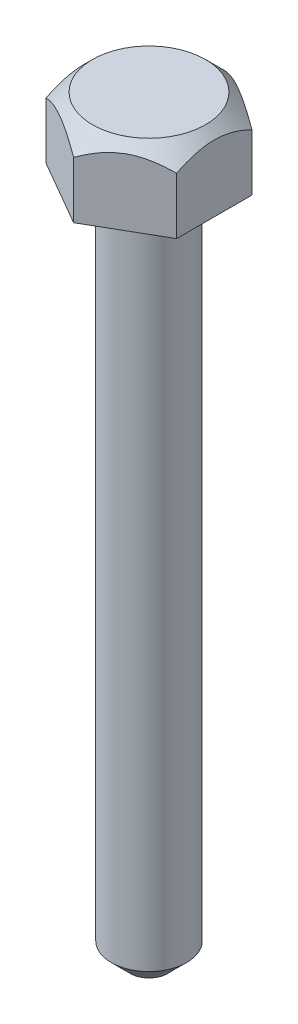
ISO-10303-21;
HEADER;
FILE_DESCRIPTION(('STEP AP214'),'2;1');
FILE_NAME('part.step','',(''),(''),'','','');
FILE_SCHEMA(('AUTOMOTIVE_DESIGN { 1 0 10303 214 1 1 1 1 }'));
ENDSEC;
DATA;
#1=APPLICATION_CONTEXT('core data for automotive mechanical design processes');
#2=APPLICATION_PROTOCOL_DEFINITION('international standard','automotive_design',2000,#1);
#3=PRODUCT_CONTEXT('',#1,'mechanical');
#4=PRODUCT('Part','Part','',(#3));
#5=PRODUCT_RELATED_PRODUCT_CATEGORY('part','',(#4));
#6=PRODUCT_DEFINITION_FORMATION('','',#4);
#7=PRODUCT_DEFINITION_CONTEXT('part definition',#1,'design');
#8=PRODUCT_DEFINITION('design','',#6,#7);
#9=PRODUCT_DEFINITION_SHAPE('','',#8);
#10=(LENGTH_UNIT() NAMED_UNIT(*) SI_UNIT(.MILLI.,.METRE.));
#11=(NAMED_UNIT(*) PLANE_ANGLE_UNIT() SI_UNIT($,.RADIAN.));
#12=(NAMED_UNIT(*) SI_UNIT($,.STERADIAN.) SOLID_ANGLE_UNIT());
#13=UNCERTAINTY_MEASURE_WITH_UNIT(LENGTH_MEASURE(1.E-05),#10,'distance_accuracy_value','');
#14=(GEOMETRIC_REPRESENTATION_CONTEXT(3) GLOBAL_UNCERTAINTY_ASSIGNED_CONTEXT((#13)) GLOBAL_UNIT_ASSIGNED_CONTEXT((#10,
#11,#12)) REPRESENTATION_CONTEXT('',''));
#15=CARTESIAN_POINT('',(0.,0.,0.));
#16=DIRECTION('',(0.,0.,1.));
#17=DIRECTION('',(1.,0.,0.));
#18=AXIS2_PLACEMENT_3D('',#15,#16,#17);
#19=CARTESIAN_POINT('',(0.,31.75,0.));
#20=DIRECTION('',(0.,-1.,0.));
#21=DIRECTION('',(0.,0.,-1.));
#22=AXIS2_PLACEMENT_3D('',#19,#20,#21);
#23=CONICAL_SURFACE('',#22,2.38125,0.785398163397449);
#24=CARTESIAN_POINT('',(0.,31.75,0.));
#25=DIRECTION('',(0.,-1.,0.));
#26=DIRECTION('',(0.,0.,-1.));
#27=AXIS2_PLACEMENT_3D('',#24,#25,#26);
#28=CIRCLE('',#27,2.38125);
#29=CARTESIAN_POINT('',(0.,31.75,-2.38125));
#30=VERTEX_POINT('',#29);
#31=EDGE_CURVE('E12',#30,#30,#28,.T.);
#32=ORIENTED_EDGE('',*,*,#31,.T.);
#33=EDGE_LOOP('',(#32));
#34=FACE_BOUND('',#33,.T.);
#35=CARTESIAN_POINT('',(-2.74963065701559,29.9378261861884,-3.16612294964081));
#36=CARTESIAN_POINT('',(-2.74963065701559,29.9960187363222,-3.08903133648161));
#37=CARTESIAN_POINT('',(-2.74963065701559,30.0536487782433,-3.01150809166808));
#38=CARTESIAN_POINT('',(-2.74963065701559,30.1675319923487,-2.85542807380412));
#39=CARTESIAN_POINT('',(-2.74963065701559,30.2237848152629,-2.77687104619031));
#40=CARTESIAN_POINT('',(-2.74963065701559,30.3350616930791,-2.61797855474567));
#41=CARTESIAN_POINT('',(-2.74963065701559,30.3900728499452,-2.53763402732732));
#42=CARTESIAN_POINT('',(-2.74963065701559,30.4980418203144,-2.37558121242053));
#43=CARTESIAN_POINT('',(-2.74963065701559,30.5509997788858,-2.29387302186709));
#44=CARTESIAN_POINT('',(-2.74963065701559,30.657368931677,-2.12414769833709));
#45=CARTESIAN_POINT('',(-2.74963065701559,30.7106321667214,-2.03603736361169));
#46=CARTESIAN_POINT('',(-2.74963065701559,30.8136386905298,-1.85778556263257));
#47=CARTESIAN_POINT('',(-2.74963065701559,30.8633824435313,-1.7676443663356));
#48=CARTESIAN_POINT('',(-2.74963065701559,30.9583008123893,-1.58530141000871));
#49=CARTESIAN_POINT('',(-2.74963065701559,31.0034882448126,-1.49310637429645));
#50=CARTESIAN_POINT('',(-2.74963065701559,31.0882742131857,-1.30620190033137));
#51=CARTESIAN_POINT('',(-2.74963065701559,31.1278752796983,-1.21149362379928));
#52=CARTESIAN_POINT('',(-2.74963065701559,31.1971729194163,-1.02714684103492));
#53=CARTESIAN_POINT('',(-2.74963065701559,31.227410084378,-0.937713677321361));
#54=CARTESIAN_POINT('',(-2.74963065701559,31.2807095912424,-0.756694160930869));
#55=CARTESIAN_POINT('',(-2.74963065701559,31.3037714388657,-0.665107660386241));
#56=CARTESIAN_POINT('',(-2.74963065701559,31.3411323063313,-0.481851640632345));
#57=CARTESIAN_POINT('',(-2.74963065701559,31.3555814631808,-0.390213237886202));
#58=CARTESIAN_POINT('',(-2.74963065701559,31.3754364791125,-0.205956837029922));
#59=CARTESIAN_POINT('',(-2.74963065701559,31.3808438927203,-0.113339010065929));
#60=CARTESIAN_POINT('',(-2.74963065701559,31.3822139007687,0.0686109243074829));
#61=CARTESIAN_POINT('',(-2.74963065701559,31.3785112730497,0.157940619209332));
#62=CARTESIAN_POINT('',(-2.74963065701559,31.3626040650417,0.33583421379749));
#63=CARTESIAN_POINT('',(-2.74963065701559,31.3503986588284,0.42439803824419));
#64=CARTESIAN_POINT('',(-2.74963065701559,31.3179451290097,0.601619179481625));
#65=CARTESIAN_POINT('',(-2.74963065701559,31.2975601391447,0.690251066287129));
#66=CARTESIAN_POINT('',(-2.74963065701559,31.2498309996399,0.865574856097047));
#67=CARTESIAN_POINT('',(-2.74963065701559,31.2224874322994,0.952266920767292));
#68=CARTESIAN_POINT('',(-2.74963065701559,31.1261123809431,1.22522750425492));
#69=CARTESIAN_POINT('',(-2.74963065701559,31.046104261342,1.40763522281327));
#70=CARTESIAN_POINT('',(-2.74963065701559,30.9127592620805,1.67455827086823));
#71=CARTESIAN_POINT('',(-2.74963065701559,30.865983528678,1.76258444358176));
#72=CARTESIAN_POINT('',(-2.74963065701559,30.7688389973369,1.93663624425236));
#73=CARTESIAN_POINT('',(-2.74963065701559,30.7184708468606,2.02266222901643));
#74=CARTESIAN_POINT('',(-2.74963065701559,30.6174463630549,2.18871353265182));
#75=CARTESIAN_POINT('',(-2.74963065701559,30.5669290964001,2.26882443344473));
#76=CARTESIAN_POINT('',(-2.74963065701559,30.4637688823944,2.42767271597842));
#77=CARTESIAN_POINT('',(-2.74963065701559,30.411125774035,2.50640999303365));
#78=CARTESIAN_POINT('',(-2.74963065701559,30.3045300820544,2.6620502852447));
#79=CARTESIAN_POINT('',(-2.74963065701559,30.2505916091195,2.73896300484514));
#80=CARTESIAN_POINT('',(-2.74963065701559,30.1412882506863,2.89173734350167));
#81=CARTESIAN_POINT('',(-2.74963065701559,30.0859237615287,2.96759924579257));
#82=CARTESIAN_POINT('',(-2.74963065701559,30.0299760939032,3.04302134445863));
#83=B_SPLINE_CURVE_WITH_KNOTS('',3,(#35,#36,#37,#38,#39,#40,#41,#42,#43,#44,#45,#46,#47,#48,#49,
#50,#51,#52,#53,#54,#55,#56,#57,#58,#59,#60,#61,#62,#63,#64,#65,#66,#67,#68,#69,#70,#71,#72,#73,
#74,#75,#76,#77,#78,#79,#80,#81,#82),.UNSPECIFIED.,.F.,.F.,(4,2,2,2,2,2,2,2,2,2,2,2,2,2,2,2,2,2,
2,2,2,2,2,4),(0.,0.289773582753295,0.5796199079546,0.871712045252538,1.16378350709015,
1.47259343253319,1.78136254814295,2.08923735751285,2.39697225199875,2.67994278231871,
2.9629328010523,3.24083334632491,3.51868610789997,3.7864817817779,4.05430347183405,
4.32680699893145,4.59928773020689,5.19497624025702,5.49399962500749,5.79296925222222,
6.07706145966094,6.36117522435872,6.64298109859546,6.92470947658771),.UNSPECIFIED.);
#84=CARTESIAN_POINT('',(-2.74963065701559,30.95625,-1.5875));
#85=VERTEX_POINT('',#84);
#86=CARTESIAN_POINT('',(-2.74963065701559,30.95625,1.5875));
#87=VERTEX_POINT('',#86);
#88=EDGE_CURVE('E111',#85,#87,#83,.T.);
#89=ORIENTED_EDGE('',*,*,#88,.T.);
#90=CARTESIAN_POINT('',(-2.74983065701559,30.9561345236472,1.58738452994616));
#91=CARTESIAN_POINT('',(-2.65531245178898,31.0106581647549,1.64195464117706));
#92=CARTESIAN_POINT('',(-2.55921377830007,31.0619795547951,1.69743723618465));
#93=CARTESIAN_POINT('',(-2.36325801423393,31.155947799292,1.81057234931749));
#94=CARTESIAN_POINT('',(-2.26338228783998,31.1985423701216,1.86823562683655));
#95=CARTESIAN_POINT('',(-2.06198765433305,31.2715077010166,1.98451087270513));
#96=CARTESIAN_POINT('',(-1.96052003698704,31.3020618564119,2.04309322889387));
#97=CARTESIAN_POINT('',(-1.75535102416081,31.3491368686645,2.16154761367847));
#98=CARTESIAN_POINT('',(-1.6516558962644,31.3656928655858,2.22141602368311));
#99=CARTESIAN_POINT('',(-1.47294251447386,31.380630667687,2.32459624276767));
#100=CARTESIAN_POINT('',(-1.39815513742724,31.3828419261114,2.36777475503752));
#101=CARTESIAN_POINT('',(-1.24870263820707,31.379116461875,2.45406119569335));
#102=CARTESIAN_POINT('',(-1.17403756807869,31.3731768827398,2.49716909403103));
#103=CARTESIAN_POINT('',(-1.02541244666378,31.3534877428608,2.58297784788827));
#104=CARTESIAN_POINT('',(-0.951453278283342,31.339729445739,2.62567819366176));
#105=CARTESIAN_POINT('',(-0.804813876593977,31.3051580960499,2.71034049170092));
#106=CARTESIAN_POINT('',(-0.732133545686656,31.2843455843246,2.75230250031505));
#107=CARTESIAN_POINT('',(-0.545972006444742,31.2225604368447,2.85978291510912));
#108=CARTESIAN_POINT('',(-0.43364497717558,31.1769310263298,2.92463495569495));
#109=CARTESIAN_POINT('',(-0.268477817923012,31.0999025380425,3.0199942595507));
#110=CARTESIAN_POINT('',(-0.214047846805347,31.0728383036837,3.05141941802747));
#111=CARTESIAN_POINT('',(-0.106196096671949,31.016242758387,3.11368765499956));
#112=CARTESIAN_POINT('',(-0.0527737231592212,30.9867129617814,3.14453107672788));
#113=CARTESIAN_POINT('',(0.00019999999999926,30.9561345236472,3.17511547005383));
#114=B_SPLINE_CURVE_WITH_KNOTS('',3,(#90,#91,#92,#93,#94,#95,#96,#97,#98,#99,#100,#101,#102,
#103,#104,#105,#106,#107,#108,#109,#110,#111,#112,#113),.UNSPECIFIED.,.F.,.F.,(4,2,2,2,2,2,2,2,
2,2,2,4),(0.,0.366258630892183,0.734651235377512,1.09719300366297,1.45882194554647,
1.71761114120921,1.97649105313462,2.23566079929965,2.49481067958308,2.906435232799,
3.11168939735854,3.31681841066392),.UNSPECIFIED.);
#115=CARTESIAN_POINT('',(0.,30.95625,3.175));
#116=VERTEX_POINT('',#115);
#117=EDGE_CURVE('E159',#87,#116,#114,.T.);
#118=ORIENTED_EDGE('',*,*,#117,.T.);
#119=CARTESIAN_POINT('',(-0.000199999999999783,30.9561345236472,3.17511547005383));
#120=CARTESIAN_POINT('',(0.0943182052266125,31.0106581647549,3.12054535882293));
#121=CARTESIAN_POINT('',(0.190416878715524,31.0619795547951,3.06506276381534));
#122=CARTESIAN_POINT('',(0.386372642781657,31.155947799292,2.9519276506825));
#123=CARTESIAN_POINT('',(0.486248369175612,31.1985423701216,2.89426437316344));
#124=CARTESIAN_POINT('',(0.687643002682544,31.2715077010166,2.77798912729487));
#125=CARTESIAN_POINT('',(0.789110620028548,31.3020618564119,2.71940677110612));
#126=CARTESIAN_POINT('',(0.994279632854781,31.3491368686645,2.60095238632153));
#127=CARTESIAN_POINT('',(1.09797476075119,31.3656928655858,2.54108397631688));
#128=CARTESIAN_POINT('',(1.27668814254173,31.380630667687,2.43790375723232));
#129=CARTESIAN_POINT('',(1.35147551958835,31.3828419261114,2.39472524496247));
#130=CARTESIAN_POINT('',(1.50092801880852,31.379116461875,2.30843880430665));
#131=CARTESIAN_POINT('',(1.5755930889369,31.3731768827398,2.26533090596896));
#132=CARTESIAN_POINT('',(1.72421821035181,31.3534877428608,2.17952215211172));
#133=CARTESIAN_POINT('',(1.79817737873225,31.339729445739,2.13682180633824));
#134=CARTESIAN_POINT('',(1.94481678042162,31.3051580960499,2.05215950829908));
#135=CARTESIAN_POINT('',(2.01749711132894,31.2843455843246,2.01019749968494));
#136=CARTESIAN_POINT('',(2.20365865057085,31.2225604368447,1.90271708489087));
#137=CARTESIAN_POINT('',(2.31598567984001,31.1769310263298,1.83786504430505));
#138=CARTESIAN_POINT('',(2.48115283909258,31.0999025380425,1.74250574044929));
#139=CARTESIAN_POINT('',(2.53558281021024,31.0728383036837,1.71108058197252));
#140=CARTESIAN_POINT('',(2.64343456034364,31.016242758387,1.64881234500043));
#141=CARTESIAN_POINT('',(2.69685693385637,30.9867129617814,1.61796892327211));
#142=CARTESIAN_POINT('',(2.74983065701559,30.9561345236472,1.58738452994616));
#143=B_SPLINE_CURVE_WITH_KNOTS('',3,(#119,#120,#121,#122,#123,#124,#125,#126,#127,#128,#129,
#130,#131,#132,#133,#134,#135,#136,#137,#138,#139,#140,#141,#142),.UNSPECIFIED.,.F.,.F.,(4,2,2,
2,2,2,2,2,2,2,2,4),(0.,0.366258630892183,0.734651235377514,1.09719300366297,1.45882194554647,
1.71761114120922,1.97649105313462,2.23566079929965,2.49481067958308,2.906435232799,
3.11168939735854,3.31681841066392),.UNSPECIFIED.);
#144=CARTESIAN_POINT('',(2.74963065701559,30.95625,1.5875));
#145=VERTEX_POINT('',#144);
#146=EDGE_CURVE('E186',#116,#145,#143,.T.);
#147=ORIENTED_EDGE('',*,*,#146,.T.);
#148=CARTESIAN_POINT('',(2.74963065701559,29.9378261861884,-3.16612294964082));
#149=CARTESIAN_POINT('',(2.74963065701559,29.9960187363222,-3.08903133648161));
#150=CARTESIAN_POINT('',(2.74963065701559,30.0536487782433,-3.01150809166808));
#151=CARTESIAN_POINT('',(2.74963065701559,30.1675319923487,-2.85542807380413));
#152=CARTESIAN_POINT('',(2.74963065701559,30.2237848152629,-2.77687104619031));
#153=CARTESIAN_POINT('',(2.74963065701559,30.3350616930791,-2.61797855474567));
#154=CARTESIAN_POINT('',(2.74963065701559,30.3900728499452,-2.53763402732732));
#155=CARTESIAN_POINT('',(2.74963065701559,30.4980418203144,-2.37558121242054));
#156=CARTESIAN_POINT('',(2.74963065701559,30.5509997788858,-2.29387302186709));
#157=CARTESIAN_POINT('',(2.74963065701559,30.657368931677,-2.12414769833709));
#158=CARTESIAN_POINT('',(2.74963065701559,30.7106321667214,-2.03603736361169));
#159=CARTESIAN_POINT('',(2.74963065701559,30.8136386905298,-1.85778556263257));
#160=CARTESIAN_POINT('',(2.74963065701559,30.8633824435313,-1.7676443663356));
#161=CARTESIAN_POINT('',(2.74963065701559,30.9583008123893,-1.58530141000871));
#162=CARTESIAN_POINT('',(2.74963065701559,31.0034882448126,-1.49310637429645));
#163=CARTESIAN_POINT('',(2.74963065701559,31.0882742131857,-1.30620190033137));
#164=CARTESIAN_POINT('',(2.74963065701559,31.1278752796983,-1.21149362379928));
#165=CARTESIAN_POINT('',(2.74963065701559,31.1971729194163,-1.02714684103493));
#166=CARTESIAN_POINT('',(2.74963065701559,31.227410084378,-0.937713677321361));
#167=CARTESIAN_POINT('',(2.74963065701559,31.2807095912424,-0.756694160930869));
#168=CARTESIAN_POINT('',(2.74963065701559,31.3037714388657,-0.665107660386242));
#169=CARTESIAN_POINT('',(2.74963065701559,31.3411323063313,-0.481851640632346));
#170=CARTESIAN_POINT('',(2.74963065701559,31.3555814631808,-0.390213237886203));
#171=CARTESIAN_POINT('',(2.74963065701559,31.3754364791125,-0.205956837029923));
#172=CARTESIAN_POINT('',(2.74963065701559,31.3808438927203,-0.113339010065929));
#173=CARTESIAN_POINT('',(2.74963065701559,31.3822139007687,0.0686109243074826));
#174=CARTESIAN_POINT('',(2.74963065701559,31.3785112730497,0.157940619209332));
#175=CARTESIAN_POINT('',(2.74963065701559,31.3626040650417,0.33583421379749));
#176=CARTESIAN_POINT('',(2.74963065701559,31.3503986588284,0.42439803824419));
#177=CARTESIAN_POINT('',(2.74963065701559,31.3179451290097,0.601619179481626));
#178=CARTESIAN_POINT('',(2.74963065701559,31.2975601391447,0.690251066287129));
#179=CARTESIAN_POINT('',(2.74963065701559,31.2498309996399,0.865574856097047));
#180=CARTESIAN_POINT('',(2.74963065701559,31.2224874322994,0.952266920767292));
#181=CARTESIAN_POINT('',(2.74963065701559,31.1261123809431,1.22522750425492));
#182=CARTESIAN_POINT('',(2.74963065701559,31.046104261342,1.40763522281328));
#183=CARTESIAN_POINT('',(2.74963065701559,30.9127592620805,1.67455827086823));
#184=CARTESIAN_POINT('',(2.74963065701559,30.865983528678,1.76258444358176));
#185=CARTESIAN_POINT('',(2.74963065701559,30.7688389973369,1.93663624425236));
#186=CARTESIAN_POINT('',(2.74963065701559,30.7184708468606,2.02266222901643));
#187=CARTESIAN_POINT('',(2.74963065701559,30.6174463630549,2.18871353265182));
#188=CARTESIAN_POINT('',(2.74963065701559,30.5669290964001,2.26882443344473));
#189=CARTESIAN_POINT('',(2.74963065701559,30.4637688823944,2.42767271597842));
#190=CARTESIAN_POINT('',(2.74963065701559,30.411125774035,2.50640999303365));
#191=CARTESIAN_POINT('',(2.74963065701559,30.3045300820544,2.6620502852447));
#192=CARTESIAN_POINT('',(2.74963065701559,30.2505916091195,2.73896300484514));
#193=CARTESIAN_POINT('',(2.74963065701559,30.1412882506863,2.89173734350167));
#194=CARTESIAN_POINT('',(2.74963065701559,30.0859237615287,2.96759924579257));
#195=CARTESIAN_POINT('',(2.74963065701559,30.0299760939032,3.04302134445863));
#196=B_SPLINE_CURVE_WITH_KNOTS('',3,(#148,#149,#150,#151,#152,#153,#154,#155,#156,#157,#158,
#159,#160,#161,#162,#163,#164,#165,#166,#167,#168,#169,#170,#171,#172,#173,#174,#175,#176,#177,
#178,#179,#180,#181,#182,#183,#184,#185,#186,#187,#188,#189,#190,#191,#192,#193,#194,#195),
.UNSPECIFIED.,.F.,.F.,(4,2,2,2,2,2,2,2,2,2,2,2,2,2,2,2,2,2,2,2,2,2,2,4),(0.,0.2897735827533,
0.579619907954604,0.871712045252543,1.16378350709015,1.4725934325332,1.78136254814295,
2.08923735751286,2.39697225199875,2.67994278231872,2.96293280105231,3.24083334632491,
3.51868610789998,3.78648178177791,4.05430347183406,4.32680699893146,4.59928773020689,
5.19497624025703,5.4939996250075,5.79296925222222,6.07706145966094,6.36117522435872,
6.64298109859546,6.92470947658772),.UNSPECIFIED.);
#197=CARTESIAN_POINT('',(2.74963065701559,30.95625,-1.5875));
#198=VERTEX_POINT('',#197);
#199=EDGE_CURVE('E135',#145,#198,#196,.F.);
#200=ORIENTED_EDGE('',*,*,#199,.T.);
#201=CARTESIAN_POINT('',(2.74983065701559,30.9561345236472,-1.58738452994616));
#202=CARTESIAN_POINT('',(2.65531245178898,31.0106581647549,-1.64195464117707));
#203=CARTESIAN_POINT('',(2.55921377830007,31.0619795547951,-1.69743723618466));
#204=CARTESIAN_POINT('',(2.36325801423393,31.155947799292,-1.8105723493175));
#205=CARTESIAN_POINT('',(2.26338228783998,31.1985423701216,-1.86823562683655));
#206=CARTESIAN_POINT('',(2.06198765433305,31.2715077010166,-1.98451087270513));
#207=CARTESIAN_POINT('',(1.96052003698705,31.3020618564119,-2.04309322889387));
#208=CARTESIAN_POINT('',(1.75535102416081,31.3491368686645,-2.16154761367847));
#209=CARTESIAN_POINT('',(1.65165589626441,31.3656928655858,-2.22141602368311));
#210=CARTESIAN_POINT('',(1.47294251447386,31.380630667687,-2.32459624276767));
#211=CARTESIAN_POINT('',(1.39815513742724,31.3828419261114,-2.36777475503752));
#212=CARTESIAN_POINT('',(1.24870263820708,31.379116461875,-2.45406119569335));
#213=CARTESIAN_POINT('',(1.17403756807869,31.3731768827398,-2.49716909403103));
#214=CARTESIAN_POINT('',(1.02541244666378,31.3534877428608,-2.58297784788827));
#215=CARTESIAN_POINT('',(0.951453278283345,31.339729445739,-2.62567819366176));
#216=CARTESIAN_POINT('',(0.80481387659398,31.3051580960499,-2.71034049170092));
#217=CARTESIAN_POINT('',(0.732133545686659,31.2843455843246,-2.75230250031505));
#218=CARTESIAN_POINT('',(0.545972006444744,31.2225604368447,-2.85978291510912));
#219=CARTESIAN_POINT('',(0.433644977175582,31.1769310263298,-2.92463495569494));
#220=CARTESIAN_POINT('',(0.268477817923013,31.0999025380425,-3.0199942595507));
#221=CARTESIAN_POINT('',(0.214047846805348,31.0728383036837,-3.05141941802747));
#222=CARTESIAN_POINT('',(0.106196096671948,31.016242758387,-3.11368765499956));
#223=CARTESIAN_POINT('',(0.0527737231592209,30.9867129617814,-3.14453107672788));
#224=CARTESIAN_POINT('',(-0.000199999999999581,30.9561345236472,-3.17511547005383));
#225=B_SPLINE_CURVE_WITH_KNOTS('',3,(#201,#202,#203,#204,#205,#206,#207,#208,#209,#210,#211,
#212,#213,#214,#215,#216,#217,#218,#219,#220,#221,#222,#223,#224),.UNSPECIFIED.,.F.,.F.,(4,2,2,
2,2,2,2,2,2,2,2,4),(0.,0.366258630892185,0.734651235377513,1.09719300366296,1.45882194554647,
1.71761114120921,1.97649105313461,2.23566079929964,2.49481067958308,2.906435232799,
3.11168939735854,3.31681841066392),.UNSPECIFIED.);
#226=CARTESIAN_POINT('',(0.,30.95625,-3.175));
#227=VERTEX_POINT('',#226);
#228=EDGE_CURVE('E80',#198,#227,#225,.T.);
#229=ORIENTED_EDGE('',*,*,#228,.T.);
#230=CARTESIAN_POINT('',(0.000199999999998833,30.9561345236472,-3.17511547005383));
#231=CARTESIAN_POINT('',(-0.0943182052266129,31.0106581647549,-3.12054535882293));
#232=CARTESIAN_POINT('',(-0.190416878715525,31.0619795547951,-3.06506276381534));
#233=CARTESIAN_POINT('',(-0.386372642781658,31.155947799292,-2.9519276506825));
#234=CARTESIAN_POINT('',(-0.486248369175613,31.1985423701216,-2.89426437316344));
#235=CARTESIAN_POINT('',(-0.687643002682545,31.2715077010166,-2.77798912729487));
#236=CARTESIAN_POINT('',(-0.789110620028547,31.3020618564119,-2.71940677110612));
#237=CARTESIAN_POINT('',(-0.99427963285478,31.3491368686645,-2.60095238632153));
#238=CARTESIAN_POINT('',(-1.09797476075119,31.3656928655858,-2.54108397631688));
#239=CARTESIAN_POINT('',(-1.27668814254173,31.380630667687,-2.43790375723232));
#240=CARTESIAN_POINT('',(-1.35147551958835,31.3828419261114,-2.39472524496247));
#241=CARTESIAN_POINT('',(-1.50092801880852,31.379116461875,-2.30843880430665));
#242=CARTESIAN_POINT('',(-1.5755930889369,31.3731768827398,-2.26533090596896));
#243=CARTESIAN_POINT('',(-1.72421821035181,31.3534877428608,-2.17952215211172));
#244=CARTESIAN_POINT('',(-1.79817737873225,31.339729445739,-2.13682180633824));
#245=CARTESIAN_POINT('',(-1.94481678042162,31.3051580960499,-2.05215950829908));
#246=CARTESIAN_POINT('',(-2.01749711132894,31.2843455843246,-2.01019749968494));
#247=CARTESIAN_POINT('',(-2.20365865057085,31.2225604368447,-1.90271708489087));
#248=CARTESIAN_POINT('',(-2.31598567984001,31.1769310263298,-1.83786504430505));
#249=CARTESIAN_POINT('',(-2.48115283909258,31.0999025380425,-1.74250574044929));
#250=CARTESIAN_POINT('',(-2.53558281021024,31.0728383036837,-1.71108058197252));
#251=CARTESIAN_POINT('',(-2.64343456034364,31.016242758387,-1.64881234500043));
#252=CARTESIAN_POINT('',(-2.69685693385637,30.9867129617814,-1.61796892327211));
#253=CARTESIAN_POINT('',(-2.74983065701559,30.9561345236472,-1.58738452994616));
#254=B_SPLINE_CURVE_WITH_KNOTS('',3,(#230,#231,#232,#233,#234,#235,#236,#237,#238,#239,#240,
#241,#242,#243,#244,#245,#246,#247,#248,#249,#250,#251,#252,#253),.UNSPECIFIED.,.F.,.F.,(4,2,2,
2,2,2,2,2,2,2,2,4),(0.,0.366258630892183,0.734651235377512,1.09719300366297,1.45882194554647,
1.71761114120921,1.97649105313462,2.23566079929965,2.49481067958308,2.906435232799,
3.11168939735854,3.31681841066392),.UNSPECIFIED.);
#255=EDGE_CURVE('E131',#227,#85,#254,.T.);
#256=ORIENTED_EDGE('',*,*,#255,.T.);
#257=EDGE_LOOP('',(#89,#118,#147,#200,#229,#256));
#258=FACE_BOUND('',#257,.T.);
#259=ADVANCED_FACE('F57',(#34,#258),#23,.T.);
#260=CARTESIAN_POINT('',(-3.175,28.575,0.));
#261=DIRECTION('',(0.,1.,0.));
#262=DIRECTION('',(0.,0.,1.));
#263=AXIS2_PLACEMENT_3D('',#260,#261,#262);
#264=PLANE('',#263);
#265=CARTESIAN_POINT('',(0.,28.575,0.));
#266=DIRECTION('',(0.,-1.,0.));
#267=DIRECTION('',(0.,0.,-1.));
#268=AXIS2_PLACEMENT_3D('',#265,#266,#267);
#269=CIRCLE('',#268,1.5875);
#270=CARTESIAN_POINT('',(0.,28.575,-1.5875));
#271=VERTEX_POINT('',#270);
#272=EDGE_CURVE('E65',#271,#271,#269,.T.);
#273=ORIENTED_EDGE('',*,*,#272,.F.);
#274=EDGE_LOOP('',(#273));
#275=FACE_BOUND('',#274,.T.);
#276=DIRECTION('',(0.,0.,-1.));
#277=VECTOR('',#276,1.);
#278=CARTESIAN_POINT('',(-2.74963065701559,28.575,0.));
#279=LINE('',#278,#277);
#280=CARTESIAN_POINT('',(-2.74963065701559,28.575,1.5875));
#281=VERTEX_POINT('',#280);
#282=CARTESIAN_POINT('',(-2.74963065701559,28.575,-1.5875));
#283=VERTEX_POINT('',#282);
#284=EDGE_CURVE('E72',#281,#283,#279,.T.);
#285=ORIENTED_EDGE('',*,*,#284,.T.);
#286=DIRECTION('',(0.866025403784439,0.,-0.5));
#287=VECTOR('',#286,1.);
#288=CARTESIAN_POINT('',(-1.37481532850779,28.575,-2.38125));
#289=LINE('',#288,#287);
#290=CARTESIAN_POINT('',(0.,28.575,-3.175));
#291=VERTEX_POINT('',#290);
#292=EDGE_CURVE('E124',#283,#291,#289,.T.);
#293=ORIENTED_EDGE('',*,*,#292,.T.);
#294=DIRECTION('',(0.866025403784439,0.,0.5));
#295=VECTOR('',#294,1.);
#296=CARTESIAN_POINT('',(1.37481532850779,28.575,-2.38125));
#297=LINE('',#296,#295);
#298=CARTESIAN_POINT('',(2.74963065701559,28.575,-1.5875));
#299=VERTEX_POINT('',#298);
#300=EDGE_CURVE('E173',#291,#299,#297,.T.);
#301=ORIENTED_EDGE('',*,*,#300,.T.);
#302=DIRECTION('',(0.,0.,1.));
#303=VECTOR('',#302,1.);
#304=CARTESIAN_POINT('',(2.74963065701559,28.575,0.));
#305=LINE('',#304,#303);
#306=CARTESIAN_POINT('',(2.74963065701559,28.575,1.5875));
#307=VERTEX_POINT('',#306);
#308=EDGE_CURVE('E199',#299,#307,#305,.T.);
#309=ORIENTED_EDGE('',*,*,#308,.T.);
#310=DIRECTION('',(-0.866025403784439,0.,0.5));
#311=VECTOR('',#310,1.);
#312=CARTESIAN_POINT('',(1.37481532850779,28.575,2.38125));
#313=LINE('',#312,#311);
#314=CARTESIAN_POINT('',(0.,28.575,3.175));
#315=VERTEX_POINT('',#314);
#316=EDGE_CURVE('E193',#307,#315,#313,.T.);
#317=ORIENTED_EDGE('',*,*,#316,.T.);
#318=DIRECTION('',(-0.866025403784439,0.,-0.5));
#319=VECTOR('',#318,1.);
#320=CARTESIAN_POINT('',(-1.37481532850779,28.575,2.38125));
#321=LINE('',#320,#319);
#322=EDGE_CURVE('E127',#315,#281,#321,.T.);
#323=ORIENTED_EDGE('',*,*,#322,.T.);
#324=EDGE_LOOP('',(#285,#293,#301,#309,#317,#323));
#325=FACE_BOUND('',#324,.T.);
#326=ADVANCED_FACE('F122',(#275,#325),#264,.F.);
#327=CARTESIAN_POINT('',(0.,31.75,0.));
#328=DIRECTION('',(0.,-1.,0.));
#329=DIRECTION('',(0.,0.,-1.));
#330=AXIS2_PLACEMENT_3D('',#327,#328,#329);
#331=PLANE('',#330);
#332=ORIENTED_EDGE('',*,*,#31,.F.);
#333=EDGE_LOOP('',(#332));
#334=FACE_BOUND('',#333,.T.);
#335=ADVANCED_FACE('F59',(#334),#331,.F.);
#336=CARTESIAN_POINT('',(0.,0.,0.));
#337=DIRECTION('',(0.,-1.,0.));
#338=DIRECTION('',(0.,0.,-1.));
#339=AXIS2_PLACEMENT_3D('',#336,#337,#338);
#340=CYLINDRICAL_SURFACE('',#339,1.5875);
#341=CARTESIAN_POINT('',(0.,0.79375,0.));
#342=DIRECTION('',(0.,-1.,0.));
#343=DIRECTION('',(0.,0.,-1.));
#344=AXIS2_PLACEMENT_3D('',#341,#342,#343);
#345=CIRCLE('',#344,1.5875);
#346=CARTESIAN_POINT('',(0.,0.79375,-1.5875));
#347=VERTEX_POINT('',#346);
#348=EDGE_CURVE('E319',#347,#347,#345,.T.);
#349=ORIENTED_EDGE('',*,*,#348,.F.);
#350=EDGE_LOOP('',(#349));
#351=FACE_BOUND('',#350,.T.);
#352=ORIENTED_EDGE('',*,*,#272,.T.);
#353=EDGE_LOOP('',(#352));
#354=FACE_BOUND('',#353,.T.);
#355=ADVANCED_FACE('F222',(#351,#354),#340,.T.);
#356=CARTESIAN_POINT('',(0.,0.79375,0.));
#357=DIRECTION('',(0.,1.,0.));
#358=DIRECTION('',(0.,0.,1.));
#359=AXIS2_PLACEMENT_3D('',#356,#357,#358);
#360=CONICAL_SURFACE('',#359,1.5875,0.785398163397448);
#361=CARTESIAN_POINT('',(0.,0.,0.));
#362=DIRECTION('',(0.,-1.,0.));
#363=DIRECTION('',(0.,0.,-1.));
#364=AXIS2_PLACEMENT_3D('',#361,#362,#363);
#365=CIRCLE('',#364,0.793749999999998);
#366=CARTESIAN_POINT('',(0.,0.,-0.793749999999998));
#367=VERTEX_POINT('',#366);
#368=EDGE_CURVE('E116',#367,#367,#365,.T.);
#369=ORIENTED_EDGE('',*,*,#368,.F.);
#370=EDGE_LOOP('',(#369));
#371=FACE_BOUND('',#370,.T.);
#372=ORIENTED_EDGE('',*,*,#348,.T.);
#373=EDGE_LOOP('',(#372));
#374=FACE_BOUND('',#373,.T.);
#375=ADVANCED_FACE('F218',(#371,#374),#360,.T.);
#376=CARTESIAN_POINT('',(-0.793749999999998,0.,0.));
#377=DIRECTION('',(0.,1.,0.));
#378=DIRECTION('',(0.,0.,1.));
#379=AXIS2_PLACEMENT_3D('',#376,#377,#378);
#380=PLANE('',#379);
#381=ORIENTED_EDGE('',*,*,#368,.T.);
#382=EDGE_LOOP('',(#381));
#383=FACE_BOUND('',#382,.T.);
#384=ADVANCED_FACE('F215',(#383),#380,.F.);
#385=CARTESIAN_POINT('',(-1.37481532850779,-0.001000000000001,-2.38125));
#386=DIRECTION('',(-0.5,0.,-0.866025403784439));
#387=DIRECTION('',(-0.866025403784439,0.,0.5));
#388=AXIS2_PLACEMENT_3D('',#385,#386,#387);
#389=PLANE('',#388);
#390=DIRECTION('',(0.,1.,0.));
#391=VECTOR('',#390,1.);
#392=CARTESIAN_POINT('',(0.,-0.001000000000001,-3.175));
#393=LINE('',#392,#391);
#394=EDGE_CURVE('E117',#291,#227,#393,.T.);
#395=ORIENTED_EDGE('',*,*,#394,.F.);
#396=ORIENTED_EDGE('',*,*,#292,.F.);
#397=DIRECTION('',(0.,1.,0.));
#398=VECTOR('',#397,1.);
#399=CARTESIAN_POINT('',(-2.74963065701559,-0.001000000000001,-1.5875));
#400=LINE('',#399,#398);
#401=EDGE_CURVE('E108',#283,#85,#400,.T.);
#402=ORIENTED_EDGE('',*,*,#401,.T.);
#403=ORIENTED_EDGE('',*,*,#255,.F.);
#404=EDGE_LOOP('',(#395,#396,#402,#403));
#405=FACE_BOUND('',#404,.T.);
#406=ADVANCED_FACE('F130',(#405),#389,.T.);
#407=CARTESIAN_POINT('',(2.74963065701559,-0.001000000000001,0.));
#408=DIRECTION('',(1.,0.,0.));
#409=DIRECTION('',(0.,0.,-1.));
#410=AXIS2_PLACEMENT_3D('',#407,#408,#409);
#411=PLANE('',#410);
#412=DIRECTION('',(0.,1.,0.));
#413=VECTOR('',#412,1.);
#414=CARTESIAN_POINT('',(2.74963065701559,-0.001000000000001,1.5875));
#415=LINE('',#414,#413);
#416=EDGE_CURVE('E132',#307,#145,#415,.T.);
#417=ORIENTED_EDGE('',*,*,#416,.F.);
#418=ORIENTED_EDGE('',*,*,#308,.F.);
#419=DIRECTION('',(0.,1.,0.));
#420=VECTOR('',#419,1.);
#421=CARTESIAN_POINT('',(2.74963065701559,-0.001000000000001,-1.5875));
#422=LINE('',#421,#420);
#423=EDGE_CURVE('E166',#299,#198,#422,.T.);
#424=ORIENTED_EDGE('',*,*,#423,.T.);
#425=ORIENTED_EDGE('',*,*,#199,.F.);
#426=EDGE_LOOP('',(#417,#418,#424,#425));
#427=FACE_BOUND('',#426,.T.);
#428=ADVANCED_FACE('F155',(#427),#411,.T.);
#429=CARTESIAN_POINT('',(-1.37481532850779,-0.001000000000001,2.38125));
#430=DIRECTION('',(-0.5,0.,0.866025403784439));
#431=DIRECTION('',(0.866025403784439,0.,0.5));
#432=AXIS2_PLACEMENT_3D('',#429,#430,#431);
#433=PLANE('',#432);
#434=DIRECTION('',(0.,1.,0.));
#435=VECTOR('',#434,1.);
#436=CARTESIAN_POINT('',(-2.74963065701559,-0.001000000000001,1.5875));
#437=LINE('',#436,#435);
#438=EDGE_CURVE('E138',#281,#87,#437,.T.);
#439=ORIENTED_EDGE('',*,*,#438,.F.);
#440=ORIENTED_EDGE('',*,*,#322,.F.);
#441=DIRECTION('',(0.,1.,0.));
#442=VECTOR('',#441,1.);
#443=CARTESIAN_POINT('',(0.,-0.001000000000001,3.175));
#444=LINE('',#443,#442);
#445=EDGE_CURVE('E192',#315,#116,#444,.T.);
#446=ORIENTED_EDGE('',*,*,#445,.T.);
#447=ORIENTED_EDGE('',*,*,#117,.F.);
#448=EDGE_LOOP('',(#439,#440,#446,#447));
#449=FACE_BOUND('',#448,.T.);
#450=ADVANCED_FACE('F150',(#449),#433,.T.);
#451=CARTESIAN_POINT('',(1.37481532850779,-0.001000000000001,-2.38125));
#452=DIRECTION('',(0.5,0.,-0.866025403784439));
#453=DIRECTION('',(-0.866025403784439,0.,-0.5));
#454=AXIS2_PLACEMENT_3D('',#451,#452,#453);
#455=PLANE('',#454);
#456=ORIENTED_EDGE('',*,*,#423,.F.);
#457=ORIENTED_EDGE('',*,*,#300,.F.);
#458=ORIENTED_EDGE('',*,*,#394,.T.);
#459=ORIENTED_EDGE('',*,*,#228,.F.);
#460=EDGE_LOOP('',(#456,#457,#458,#459));
#461=FACE_BOUND('',#460,.T.);
#462=ADVANCED_FACE('F154',(#461),#455,.T.);
#463=CARTESIAN_POINT('',(1.37481532850779,-0.001000000000001,2.38125));
#464=DIRECTION('',(0.5,0.,0.866025403784439));
#465=DIRECTION('',(0.866025403784439,0.,-0.5));
#466=AXIS2_PLACEMENT_3D('',#463,#464,#465);
#467=PLANE('',#466);
#468=ORIENTED_EDGE('',*,*,#445,.F.);
#469=ORIENTED_EDGE('',*,*,#316,.F.);
#470=ORIENTED_EDGE('',*,*,#416,.T.);
#471=ORIENTED_EDGE('',*,*,#146,.F.);
#472=EDGE_LOOP('',(#468,#469,#470,#471));
#473=FACE_BOUND('',#472,.T.);
#474=ADVANCED_FACE('F178',(#473),#467,.T.);
#475=CARTESIAN_POINT('',(-2.74963065701559,-0.001000000000001,0.));
#476=DIRECTION('',(-1.,0.,0.));
#477=DIRECTION('',(0.,0.,1.));
#478=AXIS2_PLACEMENT_3D('',#475,#476,#477);
#479=PLANE('',#478);
#480=ORIENTED_EDGE('',*,*,#401,.F.);
#481=ORIENTED_EDGE('',*,*,#284,.F.);
#482=ORIENTED_EDGE('',*,*,#438,.T.);
#483=ORIENTED_EDGE('',*,*,#88,.F.);
#484=EDGE_LOOP('',(#480,#481,#482,#483));
#485=FACE_BOUND('',#484,.T.);
#486=ADVANCED_FACE('F109',(#485),#479,.T.);
#487=CLOSED_SHELL('',(#259,#326,#335,#355,#375,#384,#406,#428,#450,#462,#474,#486));
#488=MANIFOLD_SOLID_BREP('B2',#487);
#489=ADVANCED_BREP_SHAPE_REPRESENTATION('',(#18,#488),#14);
#490=SHAPE_DEFINITION_REPRESENTATION(#9,#489);
ENDSEC;
END-ISO-10303-21;
